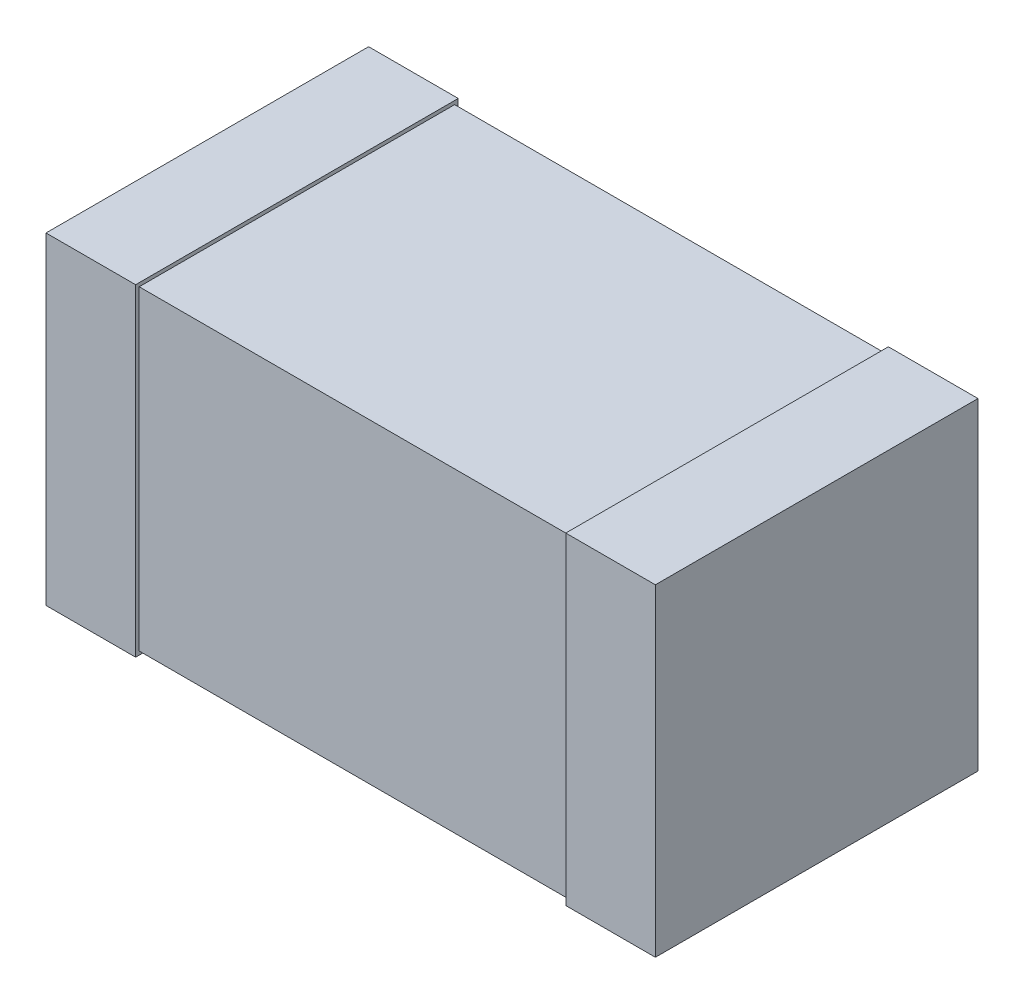
ISO-10303-21;
HEADER;
FILE_DESCRIPTION(('STEP AP214'),'2;1');
FILE_NAME('part.step','',(''),(''),'','','');
FILE_SCHEMA(('AUTOMOTIVE_DESIGN { 1 0 10303 214 1 1 1 1 }'));
ENDSEC;
DATA;
#1=APPLICATION_CONTEXT('core data for automotive mechanical design processes');
#2=APPLICATION_PROTOCOL_DEFINITION('international standard','automotive_design',2000,#1);
#3=PRODUCT_CONTEXT('',#1,'mechanical');
#4=PRODUCT('Part','Part','',(#3));
#5=PRODUCT_RELATED_PRODUCT_CATEGORY('part','',(#4));
#6=PRODUCT_DEFINITION_FORMATION('','',#4);
#7=PRODUCT_DEFINITION_CONTEXT('part definition',#1,'design');
#8=PRODUCT_DEFINITION('design','',#6,#7);
#9=PRODUCT_DEFINITION_SHAPE('','',#8);
#10=(LENGTH_UNIT() NAMED_UNIT(*) SI_UNIT(.MILLI.,.METRE.));
#11=(NAMED_UNIT(*) PLANE_ANGLE_UNIT() SI_UNIT($,.RADIAN.));
#12=(NAMED_UNIT(*) SI_UNIT($,.STERADIAN.) SOLID_ANGLE_UNIT());
#13=UNCERTAINTY_MEASURE_WITH_UNIT(LENGTH_MEASURE(1.E-05),#10,'distance_accuracy_value','');
#14=(GEOMETRIC_REPRESENTATION_CONTEXT(3) GLOBAL_UNCERTAINTY_ASSIGNED_CONTEXT((#13)) GLOBAL_UNIT_ASSIGNED_CONTEXT((#10,
#11,#12)) REPRESENTATION_CONTEXT('',''));
#15=CARTESIAN_POINT('',(0.,0.,0.));
#16=DIRECTION('',(0.,0.,1.));
#17=DIRECTION('',(1.,0.,0.));
#18=AXIS2_PLACEMENT_3D('',#15,#16,#17);
#19=CARTESIAN_POINT('',(-1.699999999971,0.9,291599.9125));
#20=DIRECTION('',(-1.,0.,0.));
#21=DIRECTION('',(0.,0.,1.));
#22=AXIS2_PLACEMENT_3D('',#19,#20,#21);
#23=PLANE('',#22);
#24=DIRECTION('',(0.,0.,-1.));
#25=VECTOR('',#24,1.);
#26=CARTESIAN_POINT('',(-1.700000000028,0.9,1.277415641196E-11));
#27=LINE('',#26,#25);
#28=CARTESIAN_POINT('',(-1.70000000003132,0.9,1.80000000000061));
#29=VERTEX_POINT('',#28);
#30=CARTESIAN_POINT('',(-1.70000000003132,0.9,9.58061730894454E-12));
#31=VERTEX_POINT('',#30);
#32=EDGE_CURVE('E117',#29,#31,#27,.T.);
#33=ORIENTED_EDGE('',*,*,#32,.T.);
#34=DIRECTION('',(0.,1.,0.));
#35=VECTOR('',#34,1.);
#36=CARTESIAN_POINT('',(-1.70000000002801,0.9,1.27741564119091E-11));
#37=LINE('',#36,#35);
#38=CARTESIAN_POINT('',(-1.70000000003132,-0.9,9.58061730895727E-12));
#39=VERTEX_POINT('',#38);
#40=EDGE_CURVE('E104',#39,#31,#37,.T.);
#41=ORIENTED_EDGE('',*,*,#40,.F.);
#42=DIRECTION('',(0.,0.,-1.));
#43=VECTOR('',#42,1.);
#44=CARTESIAN_POINT('',(-1.700000000028,-0.9,1.277415641196E-11));
#45=LINE('',#44,#43);
#46=CARTESIAN_POINT('',(-1.70000000003132,-0.9,1.80000000000061));
#47=VERTEX_POINT('',#46);
#48=EDGE_CURVE('E20',#47,#39,#45,.T.);
#49=ORIENTED_EDGE('',*,*,#48,.F.);
#50=DIRECTION('',(0.,1.,0.));
#51=VECTOR('',#50,1.);
#52=CARTESIAN_POINT('',(-1.70000000002801,0.9,1.79999999999953));
#53=LINE('',#52,#51);
#54=EDGE_CURVE('E132',#29,#47,#53,.F.);
#55=ORIENTED_EDGE('',*,*,#54,.F.);
#56=EDGE_LOOP('',(#33,#41,#49,#55));
#57=FACE_BOUND('',#56,.T.);
#58=ADVANCED_FACE('F17',(#57),#23,.T.);
#59=CARTESIAN_POINT('',(1.700000000028,0.9,291599.9125));
#60=DIRECTION('',(1.,0.,0.));
#61=DIRECTION('',(0.,0.,-1.));
#62=AXIS2_PLACEMENT_3D('',#59,#60,#61);
#63=PLANE('',#62);
#64=DIRECTION('',(0.,0.,-1.));
#65=VECTOR('',#64,1.);
#66=CARTESIAN_POINT('',(1.700000000028,0.9,1.800000000003));
#67=LINE('',#66,#65);
#68=CARTESIAN_POINT('',(1.700000000028,0.9,2.20696941625215E-12));
#69=VERTEX_POINT('',#68);
#70=CARTESIAN_POINT('',(1.70000000002801,0.9,1.80000000000298));
#71=VERTEX_POINT('',#70);
#72=EDGE_CURVE('E143',#69,#71,#67,.F.);
#73=ORIENTED_EDGE('',*,*,#72,.T.);
#74=DIRECTION('',(0.,1.,0.));
#75=VECTOR('',#74,1.);
#76=CARTESIAN_POINT('',(1.70000000002801,0.9,1.800000000003));
#77=LINE('',#76,#75);
#78=CARTESIAN_POINT('',(1.700000000028,-0.9,1.80000000000298));
#79=VERTEX_POINT('',#78);
#80=EDGE_CURVE('E139',#79,#71,#77,.T.);
#81=ORIENTED_EDGE('',*,*,#80,.F.);
#82=DIRECTION('',(0.,0.,-1.));
#83=VECTOR('',#82,1.);
#84=CARTESIAN_POINT('',(1.700000000028,-0.9,1.800000000003));
#85=LINE('',#84,#83);
#86=CARTESIAN_POINT('',(1.700000000028,-0.9,2.20696941625215E-12));
#87=VERTEX_POINT('',#86);
#88=EDGE_CURVE('E134',#87,#79,#85,.F.);
#89=ORIENTED_EDGE('',*,*,#88,.F.);
#90=DIRECTION('',(0.,1.,0.));
#91=VECTOR('',#90,1.);
#92=CARTESIAN_POINT('',(1.70000000002801,0.9,2.94282827275728E-12));
#93=LINE('',#92,#91);
#94=EDGE_CURVE('E152',#69,#87,#93,.F.);
#95=ORIENTED_EDGE('',*,*,#94,.F.);
#96=EDGE_LOOP('',(#73,#81,#89,#95));
#97=FACE_BOUND('',#96,.T.);
#98=ADVANCED_FACE('F378',(#97),#63,.T.);
#99=CARTESIAN_POINT('',(-1.700000000028,-0.9,1.277415641196E-11));
#100=DIRECTION('',(0.,-1.,0.));
#101=DIRECTION('',(0.,0.,-1.));
#102=AXIS2_PLACEMENT_3D('',#99,#100,#101);
#103=PLANE('',#102);
#104=DIRECTION('',(0.,0.,-1.));
#105=VECTOR('',#104,1.);
#106=CARTESIAN_POINT('',(-1.199999999926,-0.9,291599.9125));
#107=LINE('',#106,#105);
#108=CARTESIAN_POINT('',(-1.19999999999281,-0.9,1.80000000000061));
#109=VERTEX_POINT('',#108);
#110=CARTESIAN_POINT('',(-1.19999999999281,-0.9,9.58053248267866E-12));
#111=VERTEX_POINT('',#110);
#112=EDGE_CURVE('E158',#109,#111,#107,.T.);
#113=ORIENTED_EDGE('',*,*,#112,.F.);
#114=DIRECTION('',(1.,0.,0.));
#115=VECTOR('',#114,1.);
#116=CARTESIAN_POINT('',(-400000.,-0.9,1.800000000173));
#117=LINE('',#116,#115);
#118=EDGE_CURVE('E113',#47,#109,#117,.T.);
#119=ORIENTED_EDGE('',*,*,#118,.F.);
#120=ORIENTED_EDGE('',*,*,#48,.T.);
#121=DIRECTION('',(-1.,0.,0.));
#122=VECTOR('',#121,1.);
#123=CARTESIAN_POINT('',(-400000.,-0.9,2.84217094304E-10));
#124=LINE('',#123,#122);
#125=EDGE_CURVE('E110',#111,#39,#124,.T.);
#126=ORIENTED_EDGE('',*,*,#125,.F.);
#127=EDGE_LOOP('',(#113,#119,#120,#126));
#128=FACE_BOUND('',#127,.T.);
#129=ADVANCED_FACE('F109',(#128),#103,.T.);
#130=CARTESIAN_POINT('',(-400000.,0.9,2.84217094304E-10));
#131=DIRECTION('',(0.,0.,-1.));
#132=DIRECTION('',(-1.,0.,0.));
#133=AXIS2_PLACEMENT_3D('',#130,#131,#132);
#134=PLANE('',#133);
#135=DIRECTION('',(1.,0.,0.));
#136=VECTOR('',#135,1.);
#137=CARTESIAN_POINT('',(-1.700000000028,0.9,1.277415641196E-11));
#138=LINE('',#137,#136);
#139=CARTESIAN_POINT('',(-1.19999999998956,0.9,9.58044765638732E-12));
#140=VERTEX_POINT('',#139);
#141=EDGE_CURVE('E119',#31,#140,#138,.T.);
#142=ORIENTED_EDGE('',*,*,#141,.T.);
#143=DIRECTION('',(0.,1.,0.));
#144=VECTOR('',#143,1.);
#145=CARTESIAN_POINT('',(-1.19999999999626,0.9,0.));
#146=LINE('',#145,#144);
#147=EDGE_CURVE('E123',#111,#140,#146,.T.);
#148=ORIENTED_EDGE('',*,*,#147,.F.);
#149=ORIENTED_EDGE('',*,*,#125,.T.);
#150=ORIENTED_EDGE('',*,*,#40,.T.);
#151=EDGE_LOOP('',(#142,#148,#149,#150));
#152=FACE_BOUND('',#151,.T.);
#153=ADVANCED_FACE('F121',(#152),#134,.T.);
#154=CARTESIAN_POINT('',(-1.700000000028,0.9,1.277415641196E-11));
#155=DIRECTION('',(0.,-1.,0.));
#156=DIRECTION('',(0.,0.,-1.));
#157=AXIS2_PLACEMENT_3D('',#154,#155,#156);
#158=PLANE('',#157);
#159=DIRECTION('',(1.,0.,0.));
#160=VECTOR('',#159,1.);
#161=CARTESIAN_POINT('',(-400000.,0.9,1.800000000173));
#162=LINE('',#161,#160);
#163=CARTESIAN_POINT('',(-1.19999999999281,0.9,1.80000000000061));
#164=VERTEX_POINT('',#163);
#165=EDGE_CURVE('E129',#164,#29,#162,.F.);
#166=ORIENTED_EDGE('',*,*,#165,.F.);
#167=DIRECTION('',(0.,0.,-1.));
#168=VECTOR('',#167,1.);
#169=CARTESIAN_POINT('',(-1.199999999926,0.9,291599.9125));
#170=LINE('',#169,#168);
#171=EDGE_CURVE('E161',#140,#164,#170,.F.);
#172=ORIENTED_EDGE('',*,*,#171,.F.);
#173=ORIENTED_EDGE('',*,*,#141,.F.);
#174=ORIENTED_EDGE('',*,*,#32,.F.);
#175=EDGE_LOOP('',(#166,#172,#173,#174));
#176=FACE_BOUND('',#175,.T.);
#177=ADVANCED_FACE('F351',(#176),#158,.F.);
#178=CARTESIAN_POINT('',(-400000.,0.9,1.800000000173));
#179=DIRECTION('',(0.,0.,1.));
#180=DIRECTION('',(1.,0.,0.));
#181=AXIS2_PLACEMENT_3D('',#178,#179,#180);
#182=PLANE('',#181);
#183=ORIENTED_EDGE('',*,*,#165,.T.);
#184=ORIENTED_EDGE('',*,*,#54,.T.);
#185=ORIENTED_EDGE('',*,*,#118,.T.);
#186=DIRECTION('',(0.,1.,0.));
#187=VECTOR('',#186,1.);
#188=CARTESIAN_POINT('',(-1.19999999999626,0.9,1.80000000000291));
#189=LINE('',#188,#187);
#190=EDGE_CURVE('E164',#164,#109,#189,.F.);
#191=ORIENTED_EDGE('',*,*,#190,.F.);
#192=EDGE_LOOP('',(#183,#184,#185,#191));
#193=FACE_BOUND('',#192,.T.);
#194=ADVANCED_FACE('F341',(#193),#182,.T.);
#195=CARTESIAN_POINT('',(1.700000000028,-0.9,1.800000000003));
#196=DIRECTION('',(0.,-1.,0.));
#197=DIRECTION('',(0.,0.,-1.));
#198=AXIS2_PLACEMENT_3D('',#195,#196,#197);
#199=PLANE('',#198);
#200=DIRECTION('',(0.,0.,1.));
#201=VECTOR('',#200,1.);
#202=CARTESIAN_POINT('',(1.199999999983,-0.9,291599.9125));
#203=LINE('',#202,#201);
#204=CARTESIAN_POINT('',(1.199999999983,-0.9,2.20691520614352E-12));
#205=VERTEX_POINT('',#204);
#206=CARTESIAN_POINT('',(1.199999999983,-0.9,1.80000000000298));
#207=VERTEX_POINT('',#206);
#208=EDGE_CURVE('E177',#205,#207,#203,.T.);
#209=ORIENTED_EDGE('',*,*,#208,.F.);
#210=DIRECTION('',(-1.,0.,0.));
#211=VECTOR('',#210,1.);
#212=CARTESIAN_POINT('',(-400000.,-0.9,-1.705302565824E-10));
#213=LINE('',#212,#211);
#214=EDGE_CURVE('E146',#87,#205,#213,.T.);
#215=ORIENTED_EDGE('',*,*,#214,.F.);
#216=ORIENTED_EDGE('',*,*,#88,.T.);
#217=DIRECTION('',(1.,0.,0.));
#218=VECTOR('',#217,1.);
#219=CARTESIAN_POINT('',(-400000.,-0.9,1.800000000003));
#220=LINE('',#219,#218);
#221=EDGE_CURVE('E136',#207,#79,#220,.T.);
#222=ORIENTED_EDGE('',*,*,#221,.F.);
#223=EDGE_LOOP('',(#209,#215,#216,#222));
#224=FACE_BOUND('',#223,.T.);
#225=ADVANCED_FACE('F331',(#224),#199,.T.);
#226=CARTESIAN_POINT('',(-400000.,0.9,1.800000000003));
#227=DIRECTION('',(0.,0.,1.));
#228=DIRECTION('',(1.,0.,0.));
#229=AXIS2_PLACEMENT_3D('',#226,#227,#228);
#230=PLANE('',#229);
#231=DIRECTION('',(1.,0.,0.));
#232=VECTOR('',#231,1.);
#233=CARTESIAN_POINT('',(1.700000000028,0.9,1.800000000003));
#234=LINE('',#233,#232);
#235=CARTESIAN_POINT('',(1.199999999983,0.9,1.80000000000298));
#236=VERTEX_POINT('',#235);
#237=EDGE_CURVE('E141',#71,#236,#234,.F.);
#238=ORIENTED_EDGE('',*,*,#237,.T.);
#239=DIRECTION('',(0.,1.,0.));
#240=VECTOR('',#239,1.);
#241=CARTESIAN_POINT('',(1.199999999983,0.9,1.80000000000291));
#242=LINE('',#241,#240);
#243=EDGE_CURVE('E180',#207,#236,#242,.T.);
#244=ORIENTED_EDGE('',*,*,#243,.F.);
#245=ORIENTED_EDGE('',*,*,#221,.T.);
#246=ORIENTED_EDGE('',*,*,#80,.T.);
#247=EDGE_LOOP('',(#238,#244,#245,#246));
#248=FACE_BOUND('',#247,.T.);
#249=ADVANCED_FACE('F321',(#248),#230,.T.);
#250=CARTESIAN_POINT('',(1.700000000028,0.9,1.800000000003));
#251=DIRECTION('',(0.,-1.,0.));
#252=DIRECTION('',(0.,0.,-1.));
#253=AXIS2_PLACEMENT_3D('',#250,#251,#252);
#254=PLANE('',#253);
#255=DIRECTION('',(-1.,0.,0.));
#256=VECTOR('',#255,1.);
#257=CARTESIAN_POINT('',(-400000.,0.9,-1.705302565824E-10));
#258=LINE('',#257,#256);
#259=CARTESIAN_POINT('',(1.199999999983,0.9,2.20691520614352E-12));
#260=VERTEX_POINT('',#259);
#261=EDGE_CURVE('E149',#260,#69,#258,.F.);
#262=ORIENTED_EDGE('',*,*,#261,.F.);
#263=DIRECTION('',(0.,0.,1.));
#264=VECTOR('',#263,1.);
#265=CARTESIAN_POINT('',(1.199999999983,0.9,291599.9125));
#266=LINE('',#265,#264);
#267=EDGE_CURVE('E183',#236,#260,#266,.F.);
#268=ORIENTED_EDGE('',*,*,#267,.F.);
#269=ORIENTED_EDGE('',*,*,#237,.F.);
#270=ORIENTED_EDGE('',*,*,#72,.F.);
#271=EDGE_LOOP('',(#262,#268,#269,#270));
#272=FACE_BOUND('',#271,.T.);
#273=ADVANCED_FACE('F311',(#272),#254,.F.);
#274=CARTESIAN_POINT('',(-400000.,0.9,-1.705302565824E-10));
#275=DIRECTION('',(0.,0.,-1.));
#276=DIRECTION('',(-1.,0.,0.));
#277=AXIS2_PLACEMENT_3D('',#274,#275,#276);
#278=PLANE('',#277);
#279=ORIENTED_EDGE('',*,*,#261,.T.);
#280=ORIENTED_EDGE('',*,*,#94,.T.);
#281=ORIENTED_EDGE('',*,*,#214,.T.);
#282=DIRECTION('',(0.,1.,0.));
#283=VECTOR('',#282,1.);
#284=CARTESIAN_POINT('',(1.199999999983,0.9,0.));
#285=LINE('',#284,#283);
#286=EDGE_CURVE('E186',#260,#205,#285,.F.);
#287=ORIENTED_EDGE('',*,*,#286,.F.);
#288=EDGE_LOOP('',(#279,#280,#281,#287));
#289=FACE_BOUND('',#288,.T.);
#290=ADVANCED_FACE('F227',(#289),#278,.T.);
#291=CARTESIAN_POINT('',(-1.199999999983,0.88,1.779999999997));
#292=DIRECTION('',(0.,-1.,0.));
#293=DIRECTION('',(0.,0.,-1.));
#294=AXIS2_PLACEMENT_3D('',#291,#292,#293);
#295=PLANE('',#294);
#296=DIRECTION('',(0.,0.,1.));
#297=VECTOR('',#296,1.);
#298=CARTESIAN_POINT('',(1.199999999983,0.88,291599.9125));
#299=LINE('',#298,#297);
#300=CARTESIAN_POINT('',(1.199999999983,0.88,0.0200000000063496));
#301=VERTEX_POINT('',#300);
#302=CARTESIAN_POINT('',(1.199999999983,0.88,1.77999999999689));
#303=VERTEX_POINT('',#302);
#304=EDGE_CURVE('E189',#301,#303,#299,.T.);
#305=ORIENTED_EDGE('',*,*,#304,.F.);
#306=DIRECTION('',(-1.,0.,0.));
#307=VECTOR('',#306,1.);
#308=CARTESIAN_POINT('',(-400000.,0.88,0.02000000000635));
#309=LINE('',#308,#307);
#310=CARTESIAN_POINT('',(-1.19999999998963,0.88,0.0200000000063491));
#311=VERTEX_POINT('',#310);
#312=EDGE_CURVE('E175',#311,#301,#309,.F.);
#313=ORIENTED_EDGE('',*,*,#312,.F.);
#314=DIRECTION('',(0.,0.,-1.));
#315=VECTOR('',#314,1.);
#316=CARTESIAN_POINT('',(-1.199999999926,0.88,291599.9125));
#317=LINE('',#316,#315);
#318=CARTESIAN_POINT('',(-1.19999999998631,0.88,1.77999999999689));
#319=VERTEX_POINT('',#318);
#320=EDGE_CURVE('E167',#319,#311,#317,.T.);
#321=ORIENTED_EDGE('',*,*,#320,.F.);
#322=DIRECTION('',(1.,0.,0.));
#323=VECTOR('',#322,1.);
#324=CARTESIAN_POINT('',(-400000.,0.88,1.779999999997));
#325=LINE('',#324,#323);
#326=EDGE_CURVE('E155',#303,#319,#325,.F.);
#327=ORIENTED_EDGE('',*,*,#326,.F.);
#328=EDGE_LOOP('',(#305,#313,#321,#327));
#329=FACE_BOUND('',#328,.T.);
#330=ADVANCED_FACE('F212',(#329),#295,.F.);
#331=CARTESIAN_POINT('',(-400000.,0.88,1.779999999997));
#332=DIRECTION('',(0.,0.,1.));
#333=DIRECTION('',(1.,0.,0.));
#334=AXIS2_PLACEMENT_3D('',#331,#332,#333);
#335=PLANE('',#334);
#336=ORIENTED_EDGE('',*,*,#326,.T.);
#337=DIRECTION('',(0.,1.,0.));
#338=VECTOR('',#337,1.);
#339=CARTESIAN_POINT('',(-1.19999999999626,0.9,1.77999999999656));
#340=LINE('',#339,#338);
#341=CARTESIAN_POINT('',(-1.19999999998956,-0.88,1.77999999999689));
#342=VERTEX_POINT('',#341);
#343=EDGE_CURVE('E169',#342,#319,#340,.T.);
#344=ORIENTED_EDGE('',*,*,#343,.F.);
#345=DIRECTION('',(1.,0.,0.));
#346=VECTOR('',#345,1.);
#347=CARTESIAN_POINT('',(-1.199999999983,-0.88,1.779999999997));
#348=LINE('',#347,#346);
#349=CARTESIAN_POINT('',(1.199999999983,-0.88,1.77999999999689));
#350=VERTEX_POINT('',#349);
#351=EDGE_CURVE('E196',#350,#342,#348,.F.);
#352=ORIENTED_EDGE('',*,*,#351,.F.);
#353=DIRECTION('',(0.,1.,0.));
#354=VECTOR('',#353,1.);
#355=CARTESIAN_POINT('',(1.199999999983,0.9,1.77999999999656));
#356=LINE('',#355,#354);
#357=EDGE_CURVE('E192',#303,#350,#356,.F.);
#358=ORIENTED_EDGE('',*,*,#357,.F.);
#359=EDGE_LOOP('',(#336,#344,#352,#358));
#360=FACE_BOUND('',#359,.T.);
#361=ADVANCED_FACE('F218',(#360),#335,.T.);
#362=CARTESIAN_POINT('',(-1.199999999926,0.9,291599.9125));
#363=DIRECTION('',(1.,0.,0.));
#364=DIRECTION('',(0.,0.,-1.));
#365=AXIS2_PLACEMENT_3D('',#362,#363,#364);
#366=PLANE('',#365);
#367=DIRECTION('',(0.,0.,-1.));
#368=VECTOR('',#367,1.);
#369=CARTESIAN_POINT('',(-1.199999999996,-0.88,1.779999999997));
#370=LINE('',#369,#368);
#371=CARTESIAN_POINT('',(-1.19999999999288,-0.88,0.0200000000063491));
#372=VERTEX_POINT('',#371);
#373=EDGE_CURVE('E199',#342,#372,#370,.T.);
#374=ORIENTED_EDGE('',*,*,#373,.F.);
#375=ORIENTED_EDGE('',*,*,#343,.T.);
#376=ORIENTED_EDGE('',*,*,#320,.T.);
#377=DIRECTION('',(0.,1.,0.));
#378=VECTOR('',#377,1.);
#379=CARTESIAN_POINT('',(-1.19999999998299,0.88,0.02000000000635));
#380=LINE('',#379,#378);
#381=EDGE_CURVE('E172',#372,#311,#380,.T.);
#382=ORIENTED_EDGE('',*,*,#381,.F.);
#383=EDGE_LOOP('',(#374,#375,#376,#382));
#384=FACE_BOUND('',#383,.T.);
#385=ORIENTED_EDGE('',*,*,#171,.T.);
#386=ORIENTED_EDGE('',*,*,#190,.T.);
#387=ORIENTED_EDGE('',*,*,#112,.T.);
#388=ORIENTED_EDGE('',*,*,#147,.T.);
#389=EDGE_LOOP('',(#385,#386,#387,#388));
#390=FACE_BOUND('',#389,.T.);
#391=ADVANCED_FACE('F209',(#384,#390),#366,.T.);
#392=CARTESIAN_POINT('',(-400000.,0.88,0.02000000000635));
#393=DIRECTION('',(0.,0.,-1.));
#394=DIRECTION('',(-1.,0.,0.));
#395=AXIS2_PLACEMENT_3D('',#392,#393,#394);
#396=PLANE('',#395);
#397=ORIENTED_EDGE('',*,*,#312,.T.);
#398=DIRECTION('',(0.,1.,0.));
#399=VECTOR('',#398,1.);
#400=CARTESIAN_POINT('',(1.199999999983,0.9,0.0200000000063483));
#401=LINE('',#400,#399);
#402=CARTESIAN_POINT('',(1.199999999983,-0.88,0.0200000000063496));
#403=VERTEX_POINT('',#402);
#404=EDGE_CURVE('E35',#403,#301,#401,.T.);
#405=ORIENTED_EDGE('',*,*,#404,.F.);
#406=DIRECTION('',(1.,0.,0.));
#407=VECTOR('',#406,1.);
#408=CARTESIAN_POINT('',(-1.199999999983,-0.88,0.02000000000635));
#409=LINE('',#408,#407);
#410=EDGE_CURVE('E26',#372,#403,#409,.T.);
#411=ORIENTED_EDGE('',*,*,#410,.F.);
#412=ORIENTED_EDGE('',*,*,#381,.T.);
#413=EDGE_LOOP('',(#397,#405,#411,#412));
#414=FACE_BOUND('',#413,.T.);
#415=ADVANCED_FACE('F206',(#414),#396,.T.);
#416=CARTESIAN_POINT('',(1.199999999983,0.9,291599.9125));
#417=DIRECTION('',(-1.,0.,0.));
#418=DIRECTION('',(0.,0.,1.));
#419=AXIS2_PLACEMENT_3D('',#416,#417,#418);
#420=PLANE('',#419);
#421=DIRECTION('',(0.,0.,-1.));
#422=VECTOR('',#421,1.);
#423=CARTESIAN_POINT('',(1.199999999983,-0.88,1.779999999997));
#424=LINE('',#423,#422);
#425=EDGE_CURVE('E11',#403,#350,#424,.F.);
#426=ORIENTED_EDGE('',*,*,#425,.F.);
#427=ORIENTED_EDGE('',*,*,#404,.T.);
#428=ORIENTED_EDGE('',*,*,#304,.T.);
#429=ORIENTED_EDGE('',*,*,#357,.T.);
#430=EDGE_LOOP('',(#426,#427,#428,#429));
#431=FACE_BOUND('',#430,.T.);
#432=ORIENTED_EDGE('',*,*,#267,.T.);
#433=ORIENTED_EDGE('',*,*,#286,.T.);
#434=ORIENTED_EDGE('',*,*,#208,.T.);
#435=ORIENTED_EDGE('',*,*,#243,.T.);
#436=EDGE_LOOP('',(#432,#433,#434,#435));
#437=FACE_BOUND('',#436,.T.);
#438=ADVANCED_FACE('F215',(#431,#437),#420,.T.);
#439=CARTESIAN_POINT('',(-1.199999999983,-0.88,1.779999999997));
#440=DIRECTION('',(0.,-1.,0.));
#441=DIRECTION('',(0.,0.,-1.));
#442=AXIS2_PLACEMENT_3D('',#439,#440,#441);
#443=PLANE('',#442);
#444=ORIENTED_EDGE('',*,*,#410,.T.);
#445=ORIENTED_EDGE('',*,*,#425,.T.);
#446=ORIENTED_EDGE('',*,*,#351,.T.);
#447=ORIENTED_EDGE('',*,*,#373,.T.);
#448=EDGE_LOOP('',(#444,#445,#446,#447));
#449=FACE_BOUND('',#448,.T.);
#450=ADVANCED_FACE('F204',(#449),#443,.T.);
#451=CLOSED_SHELL('',(#58,#98,#129,#153,#177,#194,#225,#249,#273,#290,#330,#361,#391,#415,#438,#450));
#452=MANIFOLD_SOLID_BREP('B1',#451);
#453=ADVANCED_BREP_SHAPE_REPRESENTATION('',(#18,#452),#14);
#454=SHAPE_DEFINITION_REPRESENTATION(#9,#453);
ENDSEC;
END-ISO-10303-21;
